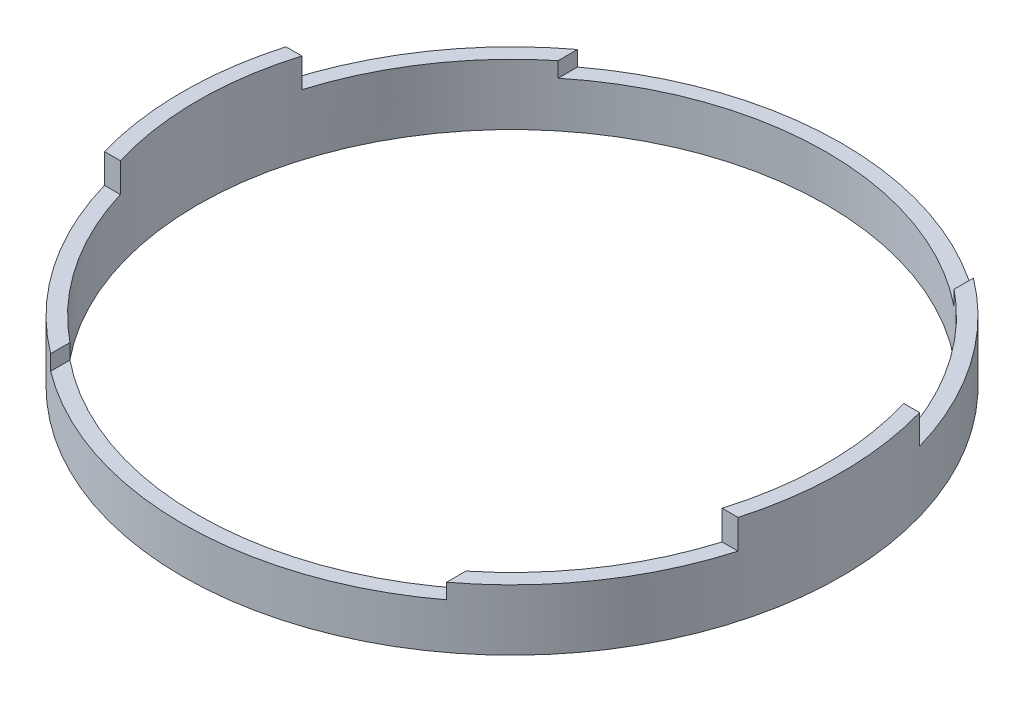
ISO-10303-21;
HEADER;
FILE_DESCRIPTION(('STEP AP214'),'2;1');
FILE_NAME('part.step','',(''),(''),'','','');
FILE_SCHEMA(('AUTOMOTIVE_DESIGN { 1 0 10303 214 1 1 1 1 }'));
ENDSEC;
DATA;
#1=APPLICATION_CONTEXT('core data for automotive mechanical design processes');
#2=APPLICATION_PROTOCOL_DEFINITION('international standard','automotive_design',2000,#1);
#3=PRODUCT_CONTEXT('',#1,'mechanical');
#4=PRODUCT('Part','Part','',(#3));
#5=PRODUCT_RELATED_PRODUCT_CATEGORY('part','',(#4));
#6=PRODUCT_DEFINITION_FORMATION('','',#4);
#7=PRODUCT_DEFINITION_CONTEXT('part definition',#1,'design');
#8=PRODUCT_DEFINITION('design','',#6,#7);
#9=PRODUCT_DEFINITION_SHAPE('','',#8);
#10=(LENGTH_UNIT() NAMED_UNIT(*) SI_UNIT(.MILLI.,.METRE.));
#11=(NAMED_UNIT(*) PLANE_ANGLE_UNIT() SI_UNIT($,.RADIAN.));
#12=(NAMED_UNIT(*) SI_UNIT($,.STERADIAN.) SOLID_ANGLE_UNIT());
#13=UNCERTAINTY_MEASURE_WITH_UNIT(LENGTH_MEASURE(1.E-05),#10,'distance_accuracy_value','');
#14=(GEOMETRIC_REPRESENTATION_CONTEXT(3) GLOBAL_UNCERTAINTY_ASSIGNED_CONTEXT((#13)) GLOBAL_UNIT_ASSIGNED_CONTEXT((#10,
#11,#12)) REPRESENTATION_CONTEXT('',''));
#15=CARTESIAN_POINT('',(0.,0.,0.));
#16=DIRECTION('',(0.,0.,1.));
#17=DIRECTION('',(1.,0.,0.));
#18=AXIS2_PLACEMENT_3D('',#15,#16,#17);
#19=CARTESIAN_POINT('',(0.,6.35,0.));
#20=DIRECTION('',(0.,1.,0.));
#21=DIRECTION('',(0.,0.,1.));
#22=AXIS2_PLACEMENT_3D('',#19,#20,#21);
#23=PLANE('',#22);
#24=DIRECTION('',(-1.,0.,0.));
#25=VECTOR('',#24,1.);
#26=CARTESIAN_POINT('',(62.7404422601562,6.35,18.923));
#27=LINE('',#26,#25);
#28=CARTESIAN_POINT('',(66.0497685082998,6.35,18.923));
#29=VERTEX_POINT('',#28);
#30=CARTESIAN_POINT('',(62.7404422601562,6.35,18.923));
#31=VERTEX_POINT('',#30);
#32=EDGE_CURVE('E196',#29,#31,#27,.T.);
#33=ORIENTED_EDGE('',*,*,#32,.T.);
#34=CARTESIAN_POINT('',(0.,6.35,0.));
#35=DIRECTION('',(0.,1.,0.));
#36=DIRECTION('',(0.,0.,1.));
#37=AXIS2_PLACEMENT_3D('',#34,#35,#36);
#38=CIRCLE('',#37,65.532);
#39=CARTESIAN_POINT('',(41.275,6.35,50.900072681677));
#40=VERTEX_POINT('',#39);
#41=EDGE_CURVE('E165',#40,#31,#38,.T.);
#42=ORIENTED_EDGE('',*,*,#41,.F.);
#43=DIRECTION('',(0.,0.,-1.));
#44=VECTOR('',#43,1.);
#45=CARTESIAN_POINT('',(41.275,6.35,50.900072681677));
#46=LINE('',#45,#44);
#47=CARTESIAN_POINT('',(41.275,6.35,54.9274632947854));
#48=VERTEX_POINT('',#47);
#49=EDGE_CURVE('E279',#48,#40,#46,.T.);
#50=ORIENTED_EDGE('',*,*,#49,.F.);
#51=CARTESIAN_POINT('',(0.,6.35,0.));
#52=DIRECTION('',(0.,1.,0.));
#53=DIRECTION('',(0.,0.,1.));
#54=AXIS2_PLACEMENT_3D('',#51,#52,#53);
#55=CIRCLE('',#54,68.707);
#56=EDGE_CURVE('E11',#48,#29,#55,.T.);
#57=ORIENTED_EDGE('',*,*,#56,.T.);
#58=EDGE_LOOP('',(#33,#42,#50,#57));
#59=FACE_BOUND('',#58,.T.);
#60=ADVANCED_FACE('F41',(#59),#23,.T.);
#61=CARTESIAN_POINT('',(-41.275,6.35,-54.9274632947854));
#62=VERTEX_POINT('',#61);
#63=CARTESIAN_POINT('',(-66.0497685082998,6.35,-18.923));
#64=VERTEX_POINT('',#63);
#65=EDGE_CURVE('E52',#62,#64,#55,.T.);
#66=ORIENTED_EDGE('',*,*,#65,.T.);
#67=DIRECTION('',(-1.,0.,0.));
#68=VECTOR('',#67,1.);
#69=CARTESIAN_POINT('',(-62.7404422601562,6.35,-18.923));
#70=LINE('',#69,#68);
#71=CARTESIAN_POINT('',(-62.7404422601562,6.35,-18.923));
#72=VERTEX_POINT('',#71);
#73=EDGE_CURVE('E171',#72,#64,#70,.T.);
#74=ORIENTED_EDGE('',*,*,#73,.F.);
#75=CARTESIAN_POINT('',(-41.275,6.35,-50.900072681677));
#76=VERTEX_POINT('',#75);
#77=EDGE_CURVE('E312',#76,#72,#38,.T.);
#78=ORIENTED_EDGE('',*,*,#77,.F.);
#79=DIRECTION('',(0.,0.,-1.));
#80=VECTOR('',#79,1.);
#81=CARTESIAN_POINT('',(-41.275,6.35,-50.900072681677));
#82=LINE('',#81,#80);
#83=EDGE_CURVE('E242',#76,#62,#82,.T.);
#84=ORIENTED_EDGE('',*,*,#83,.T.);
#85=EDGE_LOOP('',(#66,#74,#78,#84));
#86=FACE_BOUND('',#85,.T.);
#87=ADVANCED_FACE('F362',(#86),#23,.T.);
#88=CARTESIAN_POINT('',(-62.7404422601562,6.35,18.923));
#89=VERTEX_POINT('',#88);
#90=CARTESIAN_POINT('',(-41.275,6.35,50.900072681677));
#91=VERTEX_POINT('',#90);
#92=EDGE_CURVE('E315',#89,#91,#38,.T.);
#93=ORIENTED_EDGE('',*,*,#92,.F.);
#94=DIRECTION('',(1.,0.,0.));
#95=VECTOR('',#94,1.);
#96=CARTESIAN_POINT('',(-62.7404422601562,6.35,18.923));
#97=LINE('',#96,#95);
#98=CARTESIAN_POINT('',(-66.0497685082998,6.35,18.923));
#99=VERTEX_POINT('',#98);
#100=EDGE_CURVE('E212',#99,#89,#97,.T.);
#101=ORIENTED_EDGE('',*,*,#100,.F.);
#102=CARTESIAN_POINT('',(-41.275,6.35,54.9274632947854));
#103=VERTEX_POINT('',#102);
#104=EDGE_CURVE('E336',#99,#103,#55,.T.);
#105=ORIENTED_EDGE('',*,*,#104,.T.);
#106=DIRECTION('',(0.,0.,1.));
#107=VECTOR('',#106,1.);
#108=CARTESIAN_POINT('',(-41.275,6.35,50.900072681677));
#109=LINE('',#108,#107);
#110=EDGE_CURVE('E263',#91,#103,#109,.T.);
#111=ORIENTED_EDGE('',*,*,#110,.F.);
#112=EDGE_LOOP('',(#93,#101,#105,#111));
#113=FACE_BOUND('',#112,.T.);
#114=ADVANCED_FACE('F364',(#113),#23,.T.);
#115=DIRECTION('',(1.,0.,0.));
#116=VECTOR('',#115,1.);
#117=CARTESIAN_POINT('',(62.7404422601562,6.35,-18.923));
#118=LINE('',#117,#116);
#119=CARTESIAN_POINT('',(62.7404422601562,6.35,-18.923));
#120=VERTEX_POINT('',#119);
#121=CARTESIAN_POINT('',(66.0497685082998,6.35,-18.923));
#122=VERTEX_POINT('',#121);
#123=EDGE_CURVE('E59',#120,#122,#118,.T.);
#124=ORIENTED_EDGE('',*,*,#123,.T.);
#125=CARTESIAN_POINT('',(41.275,6.35,-54.9274632947854));
#126=VERTEX_POINT('',#125);
#127=EDGE_CURVE('E51',#122,#126,#55,.T.);
#128=ORIENTED_EDGE('',*,*,#127,.T.);
#129=DIRECTION('',(0.,0.,1.));
#130=VECTOR('',#129,1.);
#131=CARTESIAN_POINT('',(41.275,6.35,-50.900072681677));
#132=LINE('',#131,#130);
#133=CARTESIAN_POINT('',(41.275,6.35,-50.900072681677));
#134=VERTEX_POINT('',#133);
#135=EDGE_CURVE('E237',#126,#134,#132,.T.);
#136=ORIENTED_EDGE('',*,*,#135,.T.);
#137=EDGE_CURVE('E311',#120,#134,#38,.T.);
#138=ORIENTED_EDGE('',*,*,#137,.F.);
#139=EDGE_LOOP('',(#124,#128,#136,#138));
#140=FACE_BOUND('',#139,.T.);
#141=ADVANCED_FACE('F333',(#140),#23,.T.);
#142=CARTESIAN_POINT('',(0.,6.35,0.));
#143=DIRECTION('',(0.,-1.,0.));
#144=DIRECTION('',(0.,0.,-1.));
#145=AXIS2_PLACEMENT_3D('',#142,#143,#144);
#146=CYLINDRICAL_SURFACE('',#145,68.707);
#147=CARTESIAN_POINT('',(0.,-6.35,0.));
#148=DIRECTION('',(0.,1.,0.));
#149=DIRECTION('',(0.,0.,1.));
#150=AXIS2_PLACEMENT_3D('',#147,#148,#149);
#151=CIRCLE('',#150,68.707);
#152=CARTESIAN_POINT('',(0.,-6.35,68.707));
#153=VERTEX_POINT('',#152);
#154=EDGE_CURVE('E45',#153,#153,#151,.T.);
#155=ORIENTED_EDGE('',*,*,#154,.T.);
#156=EDGE_LOOP('',(#155));
#157=FACE_BOUND('',#156,.T.);
#158=DIRECTION('',(0.,1.,0.));
#159=VECTOR('',#158,1.);
#160=CARTESIAN_POINT('',(-41.275,3.175,-54.9274632947854));
#161=LINE('',#160,#159);
#162=CARTESIAN_POINT('',(-41.275,3.175,-54.9274632947854));
#163=VERTEX_POINT('',#162);
#164=EDGE_CURVE('E264',#163,#62,#161,.T.);
#165=ORIENTED_EDGE('',*,*,#164,.F.);
#166=CARTESIAN_POINT('',(0.,3.175,0.));
#167=DIRECTION('',(0.,-1.,0.));
#168=DIRECTION('',(0.,0.,-1.));
#169=AXIS2_PLACEMENT_3D('',#166,#167,#168);
#170=CIRCLE('',#169,68.707);
#171=CARTESIAN_POINT('',(41.275,3.175,-54.9274632947854));
#172=VERTEX_POINT('',#171);
#173=EDGE_CURVE('E245',#163,#172,#170,.T.);
#174=ORIENTED_EDGE('',*,*,#173,.T.);
#175=DIRECTION('',(0.,1.,0.));
#176=VECTOR('',#175,1.);
#177=CARTESIAN_POINT('',(41.275,3.175,-54.9274632947854));
#178=LINE('',#177,#176);
#179=EDGE_CURVE('E267',#172,#126,#178,.T.);
#180=ORIENTED_EDGE('',*,*,#179,.T.);
#181=ORIENTED_EDGE('',*,*,#127,.F.);
#182=DIRECTION('',(0.,-1.,0.));
#183=VECTOR('',#182,1.);
#184=CARTESIAN_POINT('',(66.0497685082998,12.446,-18.923));
#185=LINE('',#184,#183);
#186=CARTESIAN_POINT('',(66.0497685082998,12.446,-18.923));
#187=VERTEX_POINT('',#186);
#188=EDGE_CURVE('E203',#187,#122,#185,.T.);
#189=ORIENTED_EDGE('',*,*,#188,.F.);
#190=CARTESIAN_POINT('',(0.,12.446,0.));
#191=DIRECTION('',(0.,-1.,0.));
#192=DIRECTION('',(0.,0.,1.));
#193=AXIS2_PLACEMENT_3D('',#190,#191,#192);
#194=CIRCLE('',#193,68.707);
#195=CARTESIAN_POINT('',(66.0497685082998,12.446,18.923));
#196=VERTEX_POINT('',#195);
#197=EDGE_CURVE('E186',#187,#196,#194,.T.);
#198=ORIENTED_EDGE('',*,*,#197,.T.);
#199=DIRECTION('',(0.,-1.,0.));
#200=VECTOR('',#199,1.);
#201=CARTESIAN_POINT('',(66.0497685082998,12.446,18.923));
#202=LINE('',#201,#200);
#203=EDGE_CURVE('E172',#196,#29,#202,.T.);
#204=ORIENTED_EDGE('',*,*,#203,.T.);
#205=ORIENTED_EDGE('',*,*,#56,.F.);
#206=DIRECTION('',(0.,1.,0.));
#207=VECTOR('',#206,1.);
#208=CARTESIAN_POINT('',(41.275,3.175,54.9274632947854));
#209=LINE('',#208,#207);
#210=CARTESIAN_POINT('',(41.275,3.175,54.9274632947854));
#211=VERTEX_POINT('',#210);
#212=EDGE_CURVE('E299',#211,#48,#209,.T.);
#213=ORIENTED_EDGE('',*,*,#212,.F.);
#214=CARTESIAN_POINT('',(0.,3.175,0.));
#215=DIRECTION('',(0.,1.,0.));
#216=DIRECTION('',(0.,0.,1.));
#217=AXIS2_PLACEMENT_3D('',#214,#215,#216);
#218=CIRCLE('',#217,68.707);
#219=CARTESIAN_POINT('',(-41.275,3.175,54.9274632947854));
#220=VERTEX_POINT('',#219);
#221=EDGE_CURVE('E283',#220,#211,#218,.T.);
#222=ORIENTED_EDGE('',*,*,#221,.F.);
#223=DIRECTION('',(0.,1.,0.));
#224=VECTOR('',#223,1.);
#225=CARTESIAN_POINT('',(-41.275,3.175,54.9274632947854));
#226=LINE('',#225,#224);
#227=EDGE_CURVE('E302',#220,#103,#226,.T.);
#228=ORIENTED_EDGE('',*,*,#227,.T.);
#229=ORIENTED_EDGE('',*,*,#104,.F.);
#230=DIRECTION('',(0.,-1.,0.));
#231=VECTOR('',#230,1.);
#232=CARTESIAN_POINT('',(-66.0497685082998,12.446,18.923));
#233=LINE('',#232,#231);
#234=CARTESIAN_POINT('',(-66.0497685082998,12.446,18.923));
#235=VERTEX_POINT('',#234);
#236=EDGE_CURVE('E227',#235,#99,#233,.T.);
#237=ORIENTED_EDGE('',*,*,#236,.F.);
#238=CARTESIAN_POINT('',(0.,12.446,0.));
#239=DIRECTION('',(0.,1.,0.));
#240=DIRECTION('',(0.,0.,1.));
#241=AXIS2_PLACEMENT_3D('',#238,#239,#240);
#242=CIRCLE('',#241,68.707);
#243=CARTESIAN_POINT('',(-66.0497685082998,12.446,-18.923));
#244=VERTEX_POINT('',#243);
#245=EDGE_CURVE('E215',#244,#235,#242,.T.);
#246=ORIENTED_EDGE('',*,*,#245,.F.);
#247=DIRECTION('',(0.,-1.,0.));
#248=VECTOR('',#247,1.);
#249=CARTESIAN_POINT('',(-66.0497685082998,12.446,-18.923));
#250=LINE('',#249,#248);
#251=EDGE_CURVE('E230',#244,#64,#250,.T.);
#252=ORIENTED_EDGE('',*,*,#251,.T.);
#253=ORIENTED_EDGE('',*,*,#65,.F.);
#254=EDGE_LOOP('',(#165,#174,#180,#181,#189,#198,#204,#205,#213,#222,#228,#229,#237,#246,#252,#253));
#255=FACE_BOUND('',#254,.T.);
#256=ADVANCED_FACE('F43',(#157,#255),#146,.T.);
#257=CARTESIAN_POINT('',(0.,6.35,0.));
#258=DIRECTION('',(0.,-1.,0.));
#259=DIRECTION('',(0.,0.,-1.));
#260=AXIS2_PLACEMENT_3D('',#257,#258,#259);
#261=CYLINDRICAL_SURFACE('',#260,65.532);
#262=CARTESIAN_POINT('',(0.,-6.35,0.));
#263=DIRECTION('',(0.,1.,0.));
#264=DIRECTION('',(0.,0.,1.));
#265=AXIS2_PLACEMENT_3D('',#262,#263,#264);
#266=CIRCLE('',#265,65.532);
#267=CARTESIAN_POINT('',(0.,-6.35,65.532));
#268=VERTEX_POINT('',#267);
#269=EDGE_CURVE('E298',#268,#268,#266,.T.);
#270=ORIENTED_EDGE('',*,*,#269,.F.);
#271=EDGE_LOOP('',(#270));
#272=FACE_BOUND('',#271,.T.);
#273=CARTESIAN_POINT('',(0.,3.175,0.));
#274=DIRECTION('',(0.,1.,0.));
#275=DIRECTION('',(0.,0.,-1.));
#276=AXIS2_PLACEMENT_3D('',#273,#274,#275);
#277=CIRCLE('',#276,65.532);
#278=CARTESIAN_POINT('',(41.275,3.175,-50.900072681677));
#279=VERTEX_POINT('',#278);
#280=CARTESIAN_POINT('',(-41.275,3.175,-50.900072681677));
#281=VERTEX_POINT('',#280);
#282=EDGE_CURVE('E238',#279,#281,#277,.T.);
#283=ORIENTED_EDGE('',*,*,#282,.T.);
#284=DIRECTION('',(0.,1.,0.));
#285=VECTOR('',#284,1.);
#286=CARTESIAN_POINT('',(-41.275,3.175,-50.900072681677));
#287=LINE('',#286,#285);
#288=EDGE_CURVE('E259',#281,#76,#287,.T.);
#289=ORIENTED_EDGE('',*,*,#288,.T.);
#290=ORIENTED_EDGE('',*,*,#77,.T.);
#291=DIRECTION('',(0.,-1.,0.));
#292=VECTOR('',#291,1.);
#293=CARTESIAN_POINT('',(-62.7404422601562,12.446,-18.923));
#294=LINE('',#293,#292);
#295=CARTESIAN_POINT('',(-62.7404422601562,12.446,-18.923));
#296=VERTEX_POINT('',#295);
#297=EDGE_CURVE('E234',#296,#72,#294,.T.);
#298=ORIENTED_EDGE('',*,*,#297,.F.);
#299=CARTESIAN_POINT('',(0.,12.446,0.));
#300=DIRECTION('',(0.,-1.,0.));
#301=DIRECTION('',(0.,0.,1.));
#302=AXIS2_PLACEMENT_3D('',#299,#300,#301);
#303=CIRCLE('',#302,65.532);
#304=CARTESIAN_POINT('',(-62.7404422601562,12.446,18.923));
#305=VERTEX_POINT('',#304);
#306=EDGE_CURVE('E208',#305,#296,#303,.T.);
#307=ORIENTED_EDGE('',*,*,#306,.F.);
#308=DIRECTION('',(0.,-1.,0.));
#309=VECTOR('',#308,1.);
#310=CARTESIAN_POINT('',(-62.7404422601562,12.446,18.923));
#311=LINE('',#310,#309);
#312=EDGE_CURVE('E67',#305,#89,#311,.T.);
#313=ORIENTED_EDGE('',*,*,#312,.T.);
#314=ORIENTED_EDGE('',*,*,#92,.T.);
#315=DIRECTION('',(0.,1.,0.));
#316=VECTOR('',#315,1.);
#317=CARTESIAN_POINT('',(-41.275,3.175,50.900072681677));
#318=LINE('',#317,#316);
#319=CARTESIAN_POINT('',(-41.275,3.175,50.900072681677));
#320=VERTEX_POINT('',#319);
#321=EDGE_CURVE('E289',#320,#91,#318,.T.);
#322=ORIENTED_EDGE('',*,*,#321,.F.);
#323=CARTESIAN_POINT('',(0.,3.175,0.));
#324=DIRECTION('',(0.,-1.,0.));
#325=DIRECTION('',(0.,0.,1.));
#326=AXIS2_PLACEMENT_3D('',#323,#324,#325);
#327=CIRCLE('',#326,65.532);
#328=CARTESIAN_POINT('',(41.275,3.175,50.900072681677));
#329=VERTEX_POINT('',#328);
#330=EDGE_CURVE('E274',#329,#320,#327,.T.);
#331=ORIENTED_EDGE('',*,*,#330,.F.);
#332=DIRECTION('',(0.,1.,0.));
#333=VECTOR('',#332,1.);
#334=CARTESIAN_POINT('',(41.275,3.175,50.900072681677));
#335=LINE('',#334,#333);
#336=EDGE_CURVE('E295',#329,#40,#335,.T.);
#337=ORIENTED_EDGE('',*,*,#336,.T.);
#338=ORIENTED_EDGE('',*,*,#41,.T.);
#339=DIRECTION('',(0.,-1.,0.));
#340=VECTOR('',#339,1.);
#341=CARTESIAN_POINT('',(62.7404422601562,12.446,18.923));
#342=LINE('',#341,#340);
#343=CARTESIAN_POINT('',(62.7404422601562,12.446,18.923));
#344=VERTEX_POINT('',#343);
#345=EDGE_CURVE('E157',#344,#31,#342,.T.);
#346=ORIENTED_EDGE('',*,*,#345,.F.);
#347=CARTESIAN_POINT('',(0.,12.446,0.));
#348=DIRECTION('',(0.,1.,0.));
#349=DIRECTION('',(0.,0.,1.));
#350=AXIS2_PLACEMENT_3D('',#347,#348,#349);
#351=CIRCLE('',#350,65.532);
#352=CARTESIAN_POINT('',(62.7404422601562,12.446,-18.923));
#353=VERTEX_POINT('',#352);
#354=EDGE_CURVE('E161',#344,#353,#351,.T.);
#355=ORIENTED_EDGE('',*,*,#354,.T.);
#356=DIRECTION('',(0.,-1.,0.));
#357=VECTOR('',#356,1.);
#358=CARTESIAN_POINT('',(62.7404422601562,12.446,-18.923));
#359=LINE('',#358,#357);
#360=EDGE_CURVE('E195',#353,#120,#359,.T.);
#361=ORIENTED_EDGE('',*,*,#360,.T.);
#362=ORIENTED_EDGE('',*,*,#137,.T.);
#363=DIRECTION('',(0.,1.,0.));
#364=VECTOR('',#363,1.);
#365=CARTESIAN_POINT('',(41.275,3.175,-50.900072681677));
#366=LINE('',#365,#364);
#367=EDGE_CURVE('E252',#279,#134,#366,.T.);
#368=ORIENTED_EDGE('',*,*,#367,.F.);
#369=EDGE_LOOP('',(#283,#289,#290,#298,#307,#313,#314,#322,#331,#337,#338,#346,#355,#361,#362,#368));
#370=FACE_BOUND('',#369,.T.);
#371=ADVANCED_FACE('F160',(#272,#370),#261,.F.);
#372=CARTESIAN_POINT('',(0.,-6.35,0.));
#373=DIRECTION('',(0.,1.,0.));
#374=DIRECTION('',(0.,0.,1.));
#375=AXIS2_PLACEMENT_3D('',#372,#373,#374);
#376=PLANE('',#375);
#377=ORIENTED_EDGE('',*,*,#154,.F.);
#378=EDGE_LOOP('',(#377));
#379=FACE_BOUND('',#378,.T.);
#380=ORIENTED_EDGE('',*,*,#269,.T.);
#381=EDGE_LOOP('',(#380));
#382=FACE_BOUND('',#381,.T.);
#383=ADVANCED_FACE('F348',(#379,#382),#376,.F.);
#384=CARTESIAN_POINT('',(41.275,3.175,50.900072681677));
#385=DIRECTION('',(1.,0.,0.));
#386=DIRECTION('',(0.,0.,-1.));
#387=AXIS2_PLACEMENT_3D('',#384,#385,#386);
#388=PLANE('',#387);
#389=ORIENTED_EDGE('',*,*,#49,.T.);
#390=ORIENTED_EDGE('',*,*,#336,.F.);
#391=DIRECTION('',(0.,0.,-1.));
#392=VECTOR('',#391,1.);
#393=CARTESIAN_POINT('',(41.275,3.175,50.900072681677));
#394=LINE('',#393,#392);
#395=EDGE_CURVE('E286',#211,#329,#394,.T.);
#396=ORIENTED_EDGE('',*,*,#395,.F.);
#397=ORIENTED_EDGE('',*,*,#212,.T.);
#398=EDGE_LOOP('',(#389,#390,#396,#397));
#399=FACE_BOUND('',#398,.T.);
#400=ADVANCED_FACE('F350',(#399),#388,.F.);
#401=CARTESIAN_POINT('',(-41.275,3.175,50.900072681677));
#402=DIRECTION('',(-1.,0.,0.));
#403=DIRECTION('',(0.,0.,1.));
#404=AXIS2_PLACEMENT_3D('',#401,#402,#403);
#405=PLANE('',#404);
#406=ORIENTED_EDGE('',*,*,#110,.T.);
#407=ORIENTED_EDGE('',*,*,#227,.F.);
#408=DIRECTION('',(0.,0.,1.));
#409=VECTOR('',#408,1.);
#410=CARTESIAN_POINT('',(-41.275,3.175,50.900072681677));
#411=LINE('',#410,#409);
#412=EDGE_CURVE('E278',#320,#220,#411,.T.);
#413=ORIENTED_EDGE('',*,*,#412,.F.);
#414=ORIENTED_EDGE('',*,*,#321,.T.);
#415=EDGE_LOOP('',(#406,#407,#413,#414));
#416=FACE_BOUND('',#415,.T.);
#417=ADVANCED_FACE('F355',(#416),#405,.F.);
#418=CARTESIAN_POINT('',(0.,3.175,0.));
#419=DIRECTION('',(0.,1.,0.));
#420=DIRECTION('',(0.,0.,1.));
#421=AXIS2_PLACEMENT_3D('',#418,#419,#420);
#422=PLANE('',#421);
#423=ORIENTED_EDGE('',*,*,#330,.T.);
#424=ORIENTED_EDGE('',*,*,#412,.T.);
#425=ORIENTED_EDGE('',*,*,#221,.T.);
#426=ORIENTED_EDGE('',*,*,#395,.T.);
#427=EDGE_LOOP('',(#423,#424,#425,#426));
#428=FACE_BOUND('',#427,.T.);
#429=ADVANCED_FACE('F381',(#428),#422,.T.);
#430=CARTESIAN_POINT('',(-41.275,3.175,-50.900072681677));
#431=DIRECTION('',(1.,0.,0.));
#432=DIRECTION('',(0.,0.,-1.));
#433=AXIS2_PLACEMENT_3D('',#430,#431,#432);
#434=PLANE('',#433);
#435=ORIENTED_EDGE('',*,*,#83,.F.);
#436=ORIENTED_EDGE('',*,*,#288,.F.);
#437=DIRECTION('',(0.,0.,-1.));
#438=VECTOR('',#437,1.);
#439=CARTESIAN_POINT('',(-41.275,3.175,-50.900072681677));
#440=LINE('',#439,#438);
#441=EDGE_CURVE('E249',#281,#163,#440,.T.);
#442=ORIENTED_EDGE('',*,*,#441,.T.);
#443=ORIENTED_EDGE('',*,*,#164,.T.);
#444=EDGE_LOOP('',(#435,#436,#442,#443));
#445=FACE_BOUND('',#444,.T.);
#446=ADVANCED_FACE('F411',(#445),#434,.T.);
#447=CARTESIAN_POINT('',(41.275,3.175,-50.900072681677));
#448=DIRECTION('',(-1.,0.,0.));
#449=DIRECTION('',(0.,0.,1.));
#450=AXIS2_PLACEMENT_3D('',#447,#448,#449);
#451=PLANE('',#450);
#452=ORIENTED_EDGE('',*,*,#135,.F.);
#453=ORIENTED_EDGE('',*,*,#179,.F.);
#454=DIRECTION('',(0.,0.,1.));
#455=VECTOR('',#454,1.);
#456=CARTESIAN_POINT('',(41.275,3.175,-50.900072681677));
#457=LINE('',#456,#455);
#458=EDGE_CURVE('E241',#172,#279,#457,.T.);
#459=ORIENTED_EDGE('',*,*,#458,.T.);
#460=ORIENTED_EDGE('',*,*,#367,.T.);
#461=EDGE_LOOP('',(#452,#453,#459,#460));
#462=FACE_BOUND('',#461,.T.);
#463=ADVANCED_FACE('F330',(#462),#451,.T.);
#464=CARTESIAN_POINT('',(0.,3.175,0.));
#465=DIRECTION('',(0.,1.,0.));
#466=DIRECTION('',(0.,0.,-1.));
#467=AXIS2_PLACEMENT_3D('',#464,#465,#466);
#468=PLANE('',#467);
#469=ORIENTED_EDGE('',*,*,#282,.F.);
#470=ORIENTED_EDGE('',*,*,#458,.F.);
#471=ORIENTED_EDGE('',*,*,#173,.F.);
#472=ORIENTED_EDGE('',*,*,#441,.F.);
#473=EDGE_LOOP('',(#469,#470,#471,#472));
#474=FACE_BOUND('',#473,.T.);
#475=ADVANCED_FACE('F406',(#474),#468,.T.);
#476=CARTESIAN_POINT('',(-62.7404422601562,12.446,-18.923));
#477=DIRECTION('',(0.,0.,1.));
#478=DIRECTION('',(1.,0.,0.));
#479=AXIS2_PLACEMENT_3D('',#476,#477,#478);
#480=PLANE('',#479);
#481=ORIENTED_EDGE('',*,*,#73,.T.);
#482=ORIENTED_EDGE('',*,*,#251,.F.);
#483=DIRECTION('',(-1.,0.,0.));
#484=VECTOR('',#483,1.);
#485=CARTESIAN_POINT('',(-62.7404422601562,12.446,-18.923));
#486=LINE('',#485,#484);
#487=EDGE_CURVE('E211',#296,#244,#486,.T.);
#488=ORIENTED_EDGE('',*,*,#487,.F.);
#489=ORIENTED_EDGE('',*,*,#297,.T.);
#490=EDGE_LOOP('',(#481,#482,#488,#489));
#491=FACE_BOUND('',#490,.T.);
#492=ADVANCED_FACE('F402',(#491),#480,.F.);
#493=CARTESIAN_POINT('',(-62.7404422601562,12.446,18.923));
#494=DIRECTION('',(0.,0.,-1.));
#495=DIRECTION('',(-1.,0.,0.));
#496=AXIS2_PLACEMENT_3D('',#493,#494,#495);
#497=PLANE('',#496);
#498=ORIENTED_EDGE('',*,*,#100,.T.);
#499=ORIENTED_EDGE('',*,*,#312,.F.);
#500=DIRECTION('',(1.,0.,0.));
#501=VECTOR('',#500,1.);
#502=CARTESIAN_POINT('',(-62.7404422601562,12.446,18.923));
#503=LINE('',#502,#501);
#504=EDGE_CURVE('E218',#235,#305,#503,.T.);
#505=ORIENTED_EDGE('',*,*,#504,.F.);
#506=ORIENTED_EDGE('',*,*,#236,.T.);
#507=EDGE_LOOP('',(#498,#499,#505,#506));
#508=FACE_BOUND('',#507,.T.);
#509=ADVANCED_FACE('F398',(#508),#497,.F.);
#510=CARTESIAN_POINT('',(0.,12.446,0.));
#511=DIRECTION('',(0.,1.,0.));
#512=DIRECTION('',(0.,0.,1.));
#513=AXIS2_PLACEMENT_3D('',#510,#511,#512);
#514=PLANE('',#513);
#515=ORIENTED_EDGE('',*,*,#306,.T.);
#516=ORIENTED_EDGE('',*,*,#487,.T.);
#517=ORIENTED_EDGE('',*,*,#245,.T.);
#518=ORIENTED_EDGE('',*,*,#504,.T.);
#519=EDGE_LOOP('',(#515,#516,#517,#518));
#520=FACE_BOUND('',#519,.T.);
#521=ADVANCED_FACE('F393',(#520),#514,.T.);
#522=CARTESIAN_POINT('',(62.7404422601562,12.446,18.923));
#523=DIRECTION('',(0.,0.,1.));
#524=DIRECTION('',(1.,0.,0.));
#525=AXIS2_PLACEMENT_3D('',#522,#523,#524);
#526=PLANE('',#525);
#527=ORIENTED_EDGE('',*,*,#32,.F.);
#528=ORIENTED_EDGE('',*,*,#203,.F.);
#529=DIRECTION('',(-1.,0.,0.));
#530=VECTOR('',#529,1.);
#531=CARTESIAN_POINT('',(62.7404422601562,12.446,18.923));
#532=LINE('',#531,#530);
#533=EDGE_CURVE('E178',#196,#344,#532,.T.);
#534=ORIENTED_EDGE('',*,*,#533,.T.);
#535=ORIENTED_EDGE('',*,*,#345,.T.);
#536=EDGE_LOOP('',(#527,#528,#534,#535));
#537=FACE_BOUND('',#536,.T.);
#538=ADVANCED_FACE('F184',(#537),#526,.T.);
#539=CARTESIAN_POINT('',(62.7404422601562,12.446,-18.923));
#540=DIRECTION('',(0.,0.,-1.));
#541=DIRECTION('',(-1.,0.,0.));
#542=AXIS2_PLACEMENT_3D('',#539,#540,#541);
#543=PLANE('',#542);
#544=ORIENTED_EDGE('',*,*,#123,.F.);
#545=ORIENTED_EDGE('',*,*,#360,.F.);
#546=DIRECTION('',(1.,0.,0.));
#547=VECTOR('',#546,1.);
#548=CARTESIAN_POINT('',(62.7404422601562,12.446,-18.923));
#549=LINE('',#548,#547);
#550=EDGE_CURVE('E181',#353,#187,#549,.T.);
#551=ORIENTED_EDGE('',*,*,#550,.T.);
#552=ORIENTED_EDGE('',*,*,#188,.T.);
#553=EDGE_LOOP('',(#544,#545,#551,#552));
#554=FACE_BOUND('',#553,.T.);
#555=ADVANCED_FACE('F385',(#554),#543,.T.);
#556=CARTESIAN_POINT('',(0.,12.446,0.));
#557=DIRECTION('',(0.,1.,0.));
#558=DIRECTION('',(0.,0.,1.));
#559=AXIS2_PLACEMENT_3D('',#556,#557,#558);
#560=PLANE('',#559);
#561=ORIENTED_EDGE('',*,*,#354,.F.);
#562=ORIENTED_EDGE('',*,*,#533,.F.);
#563=ORIENTED_EDGE('',*,*,#197,.F.);
#564=ORIENTED_EDGE('',*,*,#550,.F.);
#565=EDGE_LOOP('',(#561,#562,#563,#564));
#566=FACE_BOUND('',#565,.T.);
#567=ADVANCED_FACE('F176',(#566),#560,.T.);
#568=CLOSED_SHELL('',(#60,#87,#114,#141,#256,#371,#383,#400,#417,#429,#446,#463,#475,#492,#509,
#521,#538,#555,#567));
#569=MANIFOLD_SOLID_BREP('B2',#568);
#570=ADVANCED_BREP_SHAPE_REPRESENTATION('',(#18,#569),#14);
#571=SHAPE_DEFINITION_REPRESENTATION(#9,#570);
ENDSEC;
END-ISO-10303-21;
